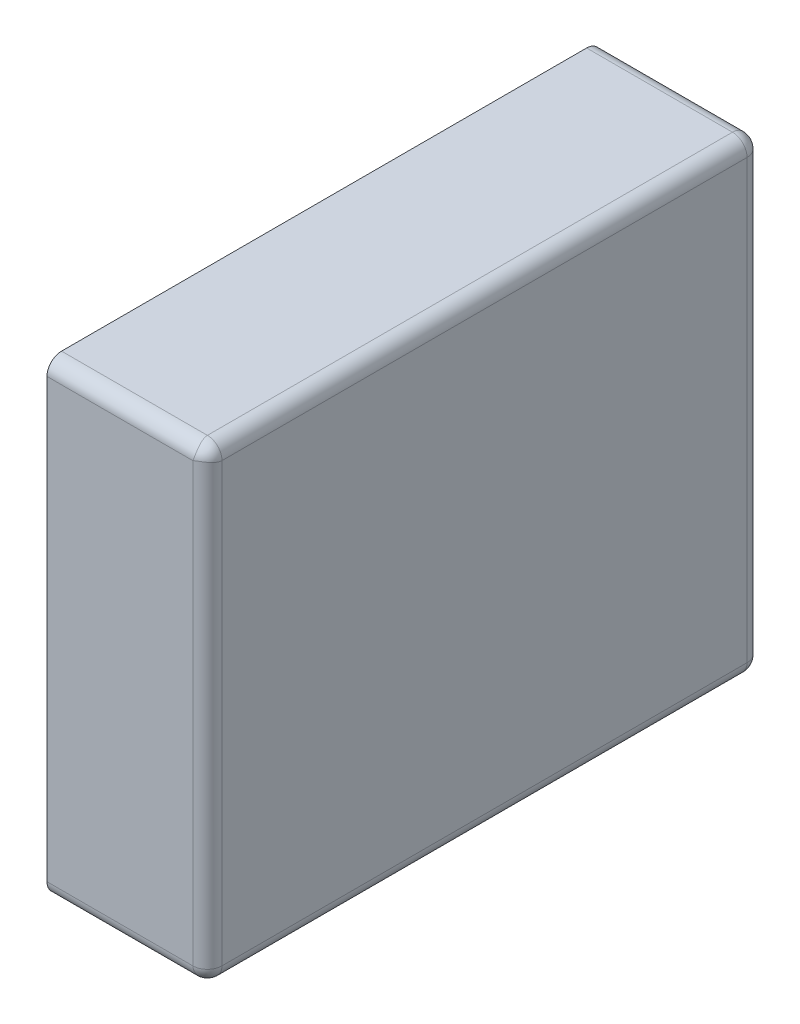
ISO-10303-21;
HEADER;
FILE_DESCRIPTION(('STEP AP214'),'2;1');
FILE_NAME('part.step','',(''),(''),'','','');
FILE_SCHEMA(('AUTOMOTIVE_DESIGN { 1 0 10303 214 1 1 1 1 }'));
ENDSEC;
DATA;
#1=APPLICATION_CONTEXT('core data for automotive mechanical design processes');
#2=APPLICATION_PROTOCOL_DEFINITION('international standard','automotive_design',2000,#1);
#3=PRODUCT_CONTEXT('',#1,'mechanical');
#4=PRODUCT('Part','Part','',(#3));
#5=PRODUCT_RELATED_PRODUCT_CATEGORY('part','',(#4));
#6=PRODUCT_DEFINITION_FORMATION('','',#4);
#7=PRODUCT_DEFINITION_CONTEXT('part definition',#1,'design');
#8=PRODUCT_DEFINITION('design','',#6,#7);
#9=PRODUCT_DEFINITION_SHAPE('','',#8);
#10=(LENGTH_UNIT() NAMED_UNIT(*) SI_UNIT(.MILLI.,.METRE.));
#11=(NAMED_UNIT(*) PLANE_ANGLE_UNIT() SI_UNIT($,.RADIAN.));
#12=(NAMED_UNIT(*) SI_UNIT($,.STERADIAN.) SOLID_ANGLE_UNIT());
#13=UNCERTAINTY_MEASURE_WITH_UNIT(LENGTH_MEASURE(1.E-05),#10,'distance_accuracy_value','');
#14=(GEOMETRIC_REPRESENTATION_CONTEXT(3) GLOBAL_UNCERTAINTY_ASSIGNED_CONTEXT((#13)) GLOBAL_UNIT_ASSIGNED_CONTEXT((#10,
#11,#12)) REPRESENTATION_CONTEXT('',''));
#15=CARTESIAN_POINT('',(0.,0.,0.));
#16=DIRECTION('',(0.,0.,1.));
#17=DIRECTION('',(1.,0.,0.));
#18=AXIS2_PLACEMENT_3D('',#15,#16,#17);
#19=CARTESIAN_POINT('',(0.25,-0.658333310554192,0.05));
#20=DIRECTION('',(-0.816496580927726,-0.408248290463864,-0.408248290463863));
#21=DIRECTION('',(0.577350269189626,-0.577350269189627,-0.577350269189625));
#22=AXIS2_PLACEMENT_3D('',#19,#20,#21);
#23=SPHERICAL_SURFACE('',#22,0.05);
#24=CARTESIAN_POINT('',(0.25,-0.658333310554192,0.05));
#25=DIRECTION('',(1.,0.,0.));
#26=DIRECTION('',(0.,0.,-1.));
#27=AXIS2_PLACEMENT_3D('',#24,#25,#26);
#28=CIRCLE('',#27,0.05);
#29=CARTESIAN_POINT('',(0.25,-0.708333310554192,0.05));
#30=VERTEX_POINT('',#29);
#31=CARTESIAN_POINT('',(0.25,-0.658333310554192,0.));
#32=VERTEX_POINT('',#31);
#33=EDGE_CURVE('E11',#30,#32,#28,.T.);
#34=ORIENTED_EDGE('',*,*,#33,.T.);
#35=CARTESIAN_POINT('',(0.25,-0.658333310554192,0.05));
#36=DIRECTION('',(0.,-1.,0.));
#37=DIRECTION('',(1.,0.,0.));
#38=AXIS2_PLACEMENT_3D('',#35,#36,#37);
#39=CIRCLE('',#38,0.05);
#40=CARTESIAN_POINT('',(0.3,-0.658333310554192,0.05));
#41=VERTEX_POINT('',#40);
#42=EDGE_CURVE('E24',#32,#41,#39,.T.);
#43=ORIENTED_EDGE('',*,*,#42,.T.);
#44=CARTESIAN_POINT('',(0.25,-0.658333310554192,0.05));
#45=DIRECTION('',(0.,0.,-1.));
#46=DIRECTION('',(0.,-1.,0.));
#47=AXIS2_PLACEMENT_3D('',#44,#45,#46);
#48=CIRCLE('',#47,0.05);
#49=EDGE_CURVE('E315',#41,#30,#48,.T.);
#50=ORIENTED_EDGE('',*,*,#49,.T.);
#51=EDGE_LOOP('',(#34,#43,#50));
#52=FACE_BOUND('',#51,.T.);
#53=ADVANCED_FACE('F17',(#52),#23,.T.);
#54=CARTESIAN_POINT('',(0.25,-0.658333310554192,1.85));
#55=DIRECTION('',(-0.408248290463863,-0.816496580927725,-0.408248290463864));
#56=DIRECTION('',(0.577350269189625,-0.577350269189627,0.577350269189626));
#57=AXIS2_PLACEMENT_3D('',#54,#55,#56);
#58=SPHERICAL_SURFACE('',#57,0.05);
#59=CARTESIAN_POINT('',(0.25,-0.658333310554192,1.9));
#60=CARTESIAN_POINT('',(0.250056476640882,-0.659164662981859,1.90000002031397));
#61=CARTESIAN_POINT('',(0.250121168311557,-0.65999542167902,1.89997917131755));
#62=CARTESIAN_POINT('',(0.250265391195623,-0.661657334802944,1.89989569556504));
#63=CARTESIAN_POINT('',(0.250344988001439,-0.66248847412573,1.89983288086806));
#64=CARTESIAN_POINT('',(0.250517234671643,-0.664148546660269,1.89966509757926));
#65=CARTESIAN_POINT('',(0.250609936033336,-0.664977457349145,1.89955995950256));
#66=CARTESIAN_POINT('',(0.250806520816706,-0.666630527199555,1.89930737239836));
#67=CARTESIAN_POINT('',(0.25091044290025,-0.667454658911413,1.89915977396341));
#68=CARTESIAN_POINT('',(0.251127528752862,-0.669095657803344,1.89882229239235));
#69=CARTESIAN_POINT('',(0.251240719867609,-0.669912494981016,1.89863228105857));
#70=CARTESIAN_POINT('',(0.251474344176626,-0.671536442570935,1.89821019528102));
#71=CARTESIAN_POINT('',(0.251594795122853,-0.672343522825329,1.89797801468437));
#72=CARTESIAN_POINT('',(0.251840892195576,-0.673945551721639,1.89747200526275));
#73=CARTESIAN_POINT('',(0.251966548375925,-0.674740472397371,1.89719809281404));
#74=CARTESIAN_POINT('',(0.252220973549075,-0.67631584408808,1.89660922840147));
#75=CARTESIAN_POINT('',(0.252349746928956,-0.677096271606362,1.89629421548598));
#76=CARTESIAN_POINT('',(0.252608300810853,-0.678640393971993,1.89562395131688));
#77=CARTESIAN_POINT('',(0.252738082163722,-0.679404071972065,1.89526866158421));
#78=CARTESIAN_POINT('',(0.252996535248399,-0.680912515415975,1.89451883535746));
#79=CARTESIAN_POINT('',(0.253125206487437,-0.681657272720296,1.89412428231988));
#80=CARTESIAN_POINT('',(0.253379323912972,-0.683125785626233,1.89329710837936));
#81=CARTESIAN_POINT('',(0.253504770480528,-0.683849543710642,1.89286449200134));
#82=CARTESIAN_POINT('',(0.253750336828149,-0.685274066953656,1.89196255359726));
#83=CARTESIAN_POINT('',(0.253870460068205,-0.685974846967864,1.89149325597784));
#84=CARTESIAN_POINT('',(0.254103304064891,-0.687351527474695,1.89051949570568));
#85=CARTESIAN_POINT('',(0.254216033516177,-0.688027456763577,1.89001507584848));
#86=CARTESIAN_POINT('',(0.254432052512975,-0.68935266005221,1.88897278428959));
#87=CARTESIAN_POINT('',(0.254535358057478,-0.690001978156978,1.88843497199004));
#88=CARTESIAN_POINT('',(0.254730542154479,-0.691272299809228,1.88732777460933));
#89=CARTESIAN_POINT('',(0.254822445957708,-0.691893363923171,1.88675846348493));
#90=CARTESIAN_POINT('',(0.254992901649071,-0.693105639944394,1.88559030584348));
#91=CARTESIAN_POINT('',(0.255071489829275,-0.693696929802492,1.88499154553938));
#92=CARTESIAN_POINT('',(0.255213463043959,-0.694848245829343,1.88376667689025));
#93=CARTESIAN_POINT('',(0.255276897009026,-0.695408368013381,1.88314066449634));
#94=CARTESIAN_POINT('',(0.255386795425953,-0.696496067335968,1.88186361983902));
#95=CARTESIAN_POINT('',(0.255433322818258,-0.697023758979868,1.88121269055809));
#96=CARTESIAN_POINT('',(0.255507737338678,-0.698045449350346,1.87988827123633));
#97=CARTESIAN_POINT('',(0.25553570253075,-0.698539581233155,1.87921488834858));
#98=CARTESIAN_POINT('',(0.255571427793508,-0.699493140439531,1.87784814127885));
#99=CARTESIAN_POINT('',(0.255579281877824,-0.699952719457549,1.87715488544524));
#100=CARTESIAN_POINT('',(0.255573335713261,-0.700836299644668,1.87575108108726));
#101=CARTESIAN_POINT('',(0.255559645939104,-0.701260470653455,1.87504063906048));
#102=CARTESIAN_POINT('',(0.255509287643763,-0.702072501389798,1.87360524818424));
#103=CARTESIAN_POINT('',(0.255472746231199,-0.702460548424196,1.87288040091383));
#104=CARTESIAN_POINT('',(0.255375493621831,-0.703199738480209,1.87141907045753));
#105=CARTESIAN_POINT('',(0.255314925981526,-0.70355108531067,1.87068268089524));
#106=CARTESIAN_POINT('',(0.255168570932992,-0.704216423264989,1.86920120834795));
#107=CARTESIAN_POINT('',(0.255082942970717,-0.704530633447628,1.86845620808787));
#108=CARTESIAN_POINT('',(0.254885566112575,-0.705121386709123,1.86696051703845));
#109=CARTESIAN_POINT('',(0.254773991607376,-0.705398162565069,1.86620989527186));
#110=CARTESIAN_POINT('',(0.254523973299393,-0.705913876381134,1.86470600292695));
#111=CARTESIAN_POINT('',(0.254385717519098,-0.706153059023342,1.8639527851382));
#112=CARTESIAN_POINT('',(0.254081755398417,-0.706593549745939,1.86244679638543));
#113=CARTESIAN_POINT('',(0.253916248962334,-0.706795112374401,1.86169405953744));
#114=CARTESIAN_POINT('',(0.253557343726359,-0.707160476248509,1.86019206042752));
#115=CARTESIAN_POINT('',(0.253364154831346,-0.707324539502695,1.85944281229227));
#116=CARTESIAN_POINT('',(0.253052732369609,-0.707542869289562,1.8583219455075));
#117=CARTESIAN_POINT('',(0.252945638881777,-0.707610870709135,1.85794983260432));
#118=CARTESIAN_POINT('',(0.252724431166697,-0.707737569445092,1.85720763742837));
#119=CARTESIAN_POINT('',(0.252610344441124,-0.707796300321971,1.85683755274195));
#120=CARTESIAN_POINT('',(0.252375149481327,-0.70790450391496,1.85609981269566));
#121=CARTESIAN_POINT('',(0.252254068989278,-0.707954010307306,1.85573215342186));
#122=CARTESIAN_POINT('',(0.252004892004011,-0.708043823540288,1.85499964182244));
#123=CARTESIAN_POINT('',(0.251876823418455,-0.708084164066007,1.85463478414168));
#124=CARTESIAN_POINT('',(0.25161368768569,-0.708155710450416,1.8539082563057));
#125=CARTESIAN_POINT('',(0.251478648512781,-0.708186949917715,1.85354657933213));
#126=CARTESIAN_POINT('',(0.251201599789781,-0.708240367053443,1.85282678964261));
#127=CARTESIAN_POINT('',(0.251059618183824,-0.708262578160602,1.85246866865684));
#128=CARTESIAN_POINT('',(0.250768722771826,-0.708298018075102,1.85175636445159));
#129=CARTESIAN_POINT('',(0.250619836783965,-0.70831128006162,1.85140217152902));
#130=CARTESIAN_POINT('',(0.250315184973883,-0.70832891062971,1.85069809533217));
#131=CARTESIAN_POINT('',(0.25015944673132,-0.708333312030094,1.85034820094293));
#132=CARTESIAN_POINT('',(0.25,-0.708333310554192,1.85));
#133=B_SPLINE_CURVE_WITH_KNOTS('',3,(#59,#60,#61,#62,#63,#64,#65,#66,#67,#68,#69,#70,#71,#72,
#73,#74,#75,#76,#77,#78,#79,#80,#81,#82,#83,#84,#85,#86,#87,#88,#89,#90,#91,#92,#93,#94,#95,#96,
#97,#98,#99,#100,#101,#102,#103,#104,#105,#106,#107,#108,#109,#110,#111,#112,#113,#114,#115,
#116,#117,#118,#119,#120,#121,#122,#123,#124,#125,#126,#127,#128,#129,#130,#131,#132),
.UNSPECIFIED.,.F.,.F.,(4,2,2,2,2,2,2,2,2,2,2,2,2,2,2,2,2,2,2,2,2,2,2,2,2,2,2,2,2,2,2,2,2,2,2,2,
4),(0.,0.00249945349828864,0.00501017636236172,0.00753105510997415,0.0100609150362242,
0.0125985278601288,0.0151426194708621,0.017691877752768,0.020244960471291,0.0228005032044077,
0.0253571273060391,0.0279134478892867,0.030468081818201,0.0330196556971654,0.035566813846877,
0.0381082262553105,0.0406425964909795,0.0431686695642027,0.0456852397199664,0.048191158143267,
0.050685340554528,0.0531667746687544,0.0556345274875088,0.0580877523875283,0.0605256959638786,
0.0629477045789643,0.0653532305615734,0.0677418379925142,0.0701132080055176,0.0712924926926686,
0.0724674051483095,0.0736379404537152,0.0748041017706803,0.0759659004268235,0.077123355986903,
0.0782764963093342,0.0794253575870824),.UNSPECIFIED.);
#134=CARTESIAN_POINT('',(0.25,-0.658333310554192,1.9));
#135=VERTEX_POINT('',#134);
#136=CARTESIAN_POINT('',(0.25,-0.708333310554192,1.85));
#137=VERTEX_POINT('',#136);
#138=EDGE_CURVE('E267',#135,#137,#133,.T.);
#139=ORIENTED_EDGE('',*,*,#138,.T.);
#140=CARTESIAN_POINT('',(0.25,-0.658333310554192,1.85));
#141=DIRECTION('',(0.,0.,1.));
#142=DIRECTION('',(1.,0.,0.));
#143=AXIS2_PLACEMENT_3D('',#140,#141,#142);
#144=CIRCLE('',#143,0.05);
#145=CARTESIAN_POINT('',(0.3,-0.658333310554192,1.85));
#146=VERTEX_POINT('',#145);
#147=EDGE_CURVE('E263',#137,#146,#144,.T.);
#148=ORIENTED_EDGE('',*,*,#147,.T.);
#149=CARTESIAN_POINT('',(0.25,-0.658333310554192,1.85));
#150=DIRECTION('',(0.,-1.,0.));
#151=DIRECTION('',(0.,0.,1.));
#152=AXIS2_PLACEMENT_3D('',#149,#150,#151);
#153=CIRCLE('',#152,0.05);
#154=EDGE_CURVE('E258',#146,#135,#153,.T.);
#155=ORIENTED_EDGE('',*,*,#154,.T.);
#156=EDGE_LOOP('',(#139,#148,#155));
#157=FACE_BOUND('',#156,.T.);
#158=ADVANCED_FACE('F292',(#157),#58,.T.);
#159=CARTESIAN_POINT('',(0.25,-0.658333310554192,0.));
#160=DIRECTION('',(0.,0.,1.));
#161=DIRECTION('',(0.707106781186548,-0.707106781186548,0.));
#162=AXIS2_PLACEMENT_3D('',#159,#160,#161);
#163=CYLINDRICAL_SURFACE('',#162,0.05);
#164=ORIENTED_EDGE('',*,*,#147,.F.);
#165=DIRECTION('',(0.,0.,-1.));
#166=VECTOR('',#165,1.);
#167=CARTESIAN_POINT('',(0.25,-0.708333310554192,0.));
#168=LINE('',#167,#166);
#169=EDGE_CURVE('E253',#137,#30,#168,.T.);
#170=ORIENTED_EDGE('',*,*,#169,.T.);
#171=ORIENTED_EDGE('',*,*,#49,.F.);
#172=DIRECTION('',(0.,0.,1.));
#173=VECTOR('',#172,1.);
#174=CARTESIAN_POINT('',(0.3,-0.658333310554192,0.));
#175=LINE('',#174,#173);
#176=EDGE_CURVE('E250',#41,#146,#175,.T.);
#177=ORIENTED_EDGE('',*,*,#176,.T.);
#178=EDGE_LOOP('',(#164,#170,#171,#177));
#179=FACE_BOUND('',#178,.T.);
#180=ADVANCED_FACE('F296',(#179),#163,.T.);
#181=CARTESIAN_POINT('',(0.25,0.841666689445808,0.05));
#182=DIRECTION('',(-0.408248290463862,-0.408248290463864,-0.816496580927726));
#183=DIRECTION('',(0.577350269189626,0.577350269189626,-0.577350269189626));
#184=AXIS2_PLACEMENT_3D('',#181,#182,#183);
#185=SPHERICAL_SURFACE('',#184,0.05);
#186=CARTESIAN_POINT('',(0.25,0.841666689445808,0.05));
#187=DIRECTION('',(0.,1.,0.));
#188=DIRECTION('',(0.,0.,-1.));
#189=AXIS2_PLACEMENT_3D('',#186,#187,#188);
#190=CIRCLE('',#189,0.05);
#191=CARTESIAN_POINT('',(0.3,0.841666689445808,0.05));
#192=VERTEX_POINT('',#191);
#193=CARTESIAN_POINT('',(0.25,0.841666689445808,0.));
#194=VERTEX_POINT('',#193);
#195=EDGE_CURVE('E248',#192,#194,#190,.T.);
#196=ORIENTED_EDGE('',*,*,#195,.T.);
#197=CARTESIAN_POINT('',(0.25,0.841666689445808,0.05));
#198=DIRECTION('',(1.,0.,0.));
#199=DIRECTION('',(0.,1.,0.));
#200=AXIS2_PLACEMENT_3D('',#197,#198,#199);
#201=CIRCLE('',#200,0.05);
#202=CARTESIAN_POINT('',(0.25,0.891666689445808,0.05));
#203=VERTEX_POINT('',#202);
#204=EDGE_CURVE('E246',#194,#203,#201,.T.);
#205=ORIENTED_EDGE('',*,*,#204,.T.);
#206=CARTESIAN_POINT('',(0.25,0.841666689445808,0.05));
#207=DIRECTION('',(0.,0.,-1.));
#208=DIRECTION('',(1.,0.,0.));
#209=AXIS2_PLACEMENT_3D('',#206,#207,#208);
#210=CIRCLE('',#209,0.05);
#211=EDGE_CURVE('E243',#203,#192,#210,.T.);
#212=ORIENTED_EDGE('',*,*,#211,.T.);
#213=EDGE_LOOP('',(#196,#205,#212));
#214=FACE_BOUND('',#213,.T.);
#215=ADVANCED_FACE('F301',(#214),#185,.T.);
#216=CARTESIAN_POINT('',(0.1625,0.841666689445808,0.05));
#217=DIRECTION('',(1.,0.,0.));
#218=DIRECTION('',(0.,0.707106781186548,-0.707106781186547));
#219=AXIS2_PLACEMENT_3D('',#216,#217,#218);
#220=CYLINDRICAL_SURFACE('',#219,0.05);
#221=CARTESIAN_POINT('',(-0.25,0.841666689445808,0.05));
#222=DIRECTION('',(1.,0.,0.));
#223=DIRECTION('',(0.,0.707106781186548,-0.707106781186547));
#224=AXIS2_PLACEMENT_3D('',#221,#222,#223);
#225=CIRCLE('',#224,0.05);
#226=CARTESIAN_POINT('',(-0.25,0.841666689445808,0.));
#227=VERTEX_POINT('',#226);
#228=CARTESIAN_POINT('',(-0.25,0.891666689445808,0.05));
#229=VERTEX_POINT('',#228);
#230=EDGE_CURVE('E239',#227,#229,#225,.T.);
#231=ORIENTED_EDGE('',*,*,#230,.T.);
#232=DIRECTION('',(1.,0.,0.));
#233=VECTOR('',#232,1.);
#234=CARTESIAN_POINT('',(0.1625,0.891666689445808,0.05));
#235=LINE('',#234,#233);
#236=EDGE_CURVE('E233',#229,#203,#235,.T.);
#237=ORIENTED_EDGE('',*,*,#236,.T.);
#238=ORIENTED_EDGE('',*,*,#204,.F.);
#239=DIRECTION('',(-1.,0.,0.));
#240=VECTOR('',#239,1.);
#241=CARTESIAN_POINT('',(0.1625,0.841666689445808,0.));
#242=LINE('',#241,#240);
#243=EDGE_CURVE('E231',#194,#227,#242,.T.);
#244=ORIENTED_EDGE('',*,*,#243,.T.);
#245=EDGE_LOOP('',(#231,#237,#238,#244));
#246=FACE_BOUND('',#245,.T.);
#247=ADVANCED_FACE('F194',(#246),#220,.T.);
#248=CARTESIAN_POINT('',(0.25,0.841666689445808,1.85));
#249=DIRECTION('',(0.408248290463863,0.408248290463863,-0.816496580927726));
#250=DIRECTION('',(0.577350269189625,0.577350269189626,0.577350269189626));
#251=AXIS2_PLACEMENT_3D('',#248,#249,#250);
#252=SPHERICAL_SURFACE('',#251,0.05);
#253=CARTESIAN_POINT('',(0.25,0.841666689445808,1.9));
#254=CARTESIAN_POINT('',(0.250348200942932,0.841826136177128,1.9000000014759));
#255=CARTESIAN_POINT('',(0.250698095332166,0.841981874419691,1.89999560007552));
#256=CARTESIAN_POINT('',(0.251402171529021,0.842286526229773,1.89997796950743));
#257=CARTESIAN_POINT('',(0.251756364451594,0.842435412217634,1.89996470752091));
#258=CARTESIAN_POINT('',(0.252468668656838,0.842726307629632,1.89992926760641));
#259=CARTESIAN_POINT('',(0.25282678964261,0.842868289235589,1.89990705649925));
#260=CARTESIAN_POINT('',(0.253546579332125,0.843145337958589,1.89985363936352));
#261=CARTESIAN_POINT('',(0.253908256305697,0.843280377131498,1.89982239989622));
#262=CARTESIAN_POINT('',(0.254634784141684,0.843543512864263,1.89975085351182));
#263=CARTESIAN_POINT('',(0.254999641822439,0.843671581449818,1.8997105129861));
#264=CARTESIAN_POINT('',(0.255732153421865,0.843920758435086,1.89962069975311));
#265=CARTESIAN_POINT('',(0.256099812695661,0.844041838927135,1.89957119336077));
#266=CARTESIAN_POINT('',(0.256837552741953,0.844277033886932,1.89946298976778));
#267=CARTESIAN_POINT('',(0.257207637428366,0.844391120612505,1.8994042588909));
#268=CARTESIAN_POINT('',(0.257949832604319,0.844612328327585,1.89927756015494));
#269=CARTESIAN_POINT('',(0.258321945507501,0.844719421815417,1.89920955873537));
#270=CARTESIAN_POINT('',(0.259442812292273,0.845030844277154,1.8989912289485));
#271=CARTESIAN_POINT('',(0.260192060427522,0.845224033172167,1.89882716569432));
#272=CARTESIAN_POINT('',(0.261694059537444,0.845582938408142,1.89846180182021));
#273=CARTESIAN_POINT('',(0.262446796385434,0.845748444844225,1.89826023919175));
#274=CARTESIAN_POINT('',(0.263952785138195,0.846052406964906,1.89781974846915));
#275=CARTESIAN_POINT('',(0.264706002926951,0.846190662745201,1.89758056582694));
#276=CARTESIAN_POINT('',(0.266209895271862,0.846440681053184,1.89706485201088));
#277=CARTESIAN_POINT('',(0.266960517038454,0.846552255558383,1.89678807615493));
#278=CARTESIAN_POINT('',(0.268456208087868,0.846749632416525,1.89619732289344));
#279=CARTESIAN_POINT('',(0.269201208347947,0.8468352603788,1.8958831127108));
#280=CARTESIAN_POINT('',(0.270682680895238,0.846981615427334,1.89521777475648));
#281=CARTESIAN_POINT('',(0.271419070457526,0.847042183067639,1.89486642792602));
#282=CARTESIAN_POINT('',(0.272880400913832,0.847139435677007,1.89412723787));
#283=CARTESIAN_POINT('',(0.273605248184243,0.84717597708957,1.89373919083561));
#284=CARTESIAN_POINT('',(0.275040639060477,0.847226335384912,1.89292716009926));
#285=CARTESIAN_POINT('',(0.275751081087255,0.847240025159069,1.89250298909048));
#286=CARTESIAN_POINT('',(0.277154885445235,0.847245971323632,1.89161940890336));
#287=CARTESIAN_POINT('',(0.277848141278855,0.847238117239316,1.89115982988534));
#288=CARTESIAN_POINT('',(0.279214888348585,0.847202391976558,1.89020627067896));
#289=CARTESIAN_POINT('',(0.279888271236327,0.847174426784487,1.88971213879615));
#290=CARTESIAN_POINT('',(0.281212690558093,0.847100012264066,1.88869044842568));
#291=CARTESIAN_POINT('',(0.281863619839021,0.847053484871761,1.88816275678178));
#292=CARTESIAN_POINT('',(0.283140664496341,0.846943586454834,1.88707505745919));
#293=CARTESIAN_POINT('',(0.283766676890247,0.846880152489767,1.88651493527515));
#294=CARTESIAN_POINT('',(0.28499154553938,0.846738179275083,1.8853636192483));
#295=CARTESIAN_POINT('',(0.285590305843476,0.846659591094879,1.8847723293902));
#296=CARTESIAN_POINT('',(0.286758463484926,0.846489135403516,1.88356005336898));
#297=CARTESIAN_POINT('',(0.287327774609329,0.846397231600287,1.88293898925504));
#298=CARTESIAN_POINT('',(0.288434971990044,0.846202047503286,1.88166866760279));
#299=CARTESIAN_POINT('',(0.288972784289588,0.846098741958783,1.88101934949802));
#300=CARTESIAN_POINT('',(0.290015075848481,0.845882722961985,1.87969414620939));
#301=CARTESIAN_POINT('',(0.290519495705679,0.845769993510699,1.8790182169205));
#302=CARTESIAN_POINT('',(0.291493255977843,0.845537149514013,1.87764153641367));
#303=CARTESIAN_POINT('',(0.291962553597264,0.845417026273957,1.87694075639946));
#304=CARTESIAN_POINT('',(0.292864492001337,0.845171459926336,1.87551623315645));
#305=CARTESIAN_POINT('',(0.293297108379355,0.84504601335878,1.87479247507204));
#306=CARTESIAN_POINT('',(0.294124282319878,0.844791895933245,1.8733239621661));
#307=CARTESIAN_POINT('',(0.294518835357465,0.844663224694207,1.87257920486178));
#308=CARTESIAN_POINT('',(0.295268661584212,0.84440477160953,1.87107076141787));
#309=CARTESIAN_POINT('',(0.29562395131688,0.844274990256661,1.8703070834178));
#310=CARTESIAN_POINT('',(0.29629421548598,0.844016436374764,1.86876296105217));
#311=CARTESIAN_POINT('',(0.296609228401466,0.843887662994882,1.86798253353389));
#312=CARTESIAN_POINT('',(0.297198092814035,0.843633237821733,1.86640716184318));
#313=CARTESIAN_POINT('',(0.297472005262752,0.843507581641384,1.86561224116745));
#314=CARTESIAN_POINT('',(0.297978014684369,0.843261484568661,1.86401021227114));
#315=CARTESIAN_POINT('',(0.298210195281024,0.843141033622434,1.86320313201674));
#316=CARTESIAN_POINT('',(0.298632281058567,0.842907409313417,1.86157918442682));
#317=CARTESIAN_POINT('',(0.298822292392348,0.84279421819867,1.86076234724915));
#318=CARTESIAN_POINT('',(0.299159773963409,0.842577132346058,1.85912134835722));
#319=CARTESIAN_POINT('',(0.299307372398355,0.842473210262514,1.85829721664536));
#320=CARTESIAN_POINT('',(0.299559959502557,0.842276625479144,1.85664414679495));
#321=CARTESIAN_POINT('',(0.299665097579262,0.842183924117451,1.85581523610608));
#322=CARTESIAN_POINT('',(0.299832880868058,0.842011677447247,1.85415516357154));
#323=CARTESIAN_POINT('',(0.299895695565037,0.841932080641431,1.85332402424875));
#324=CARTESIAN_POINT('',(0.299979171317549,0.841787857757365,1.85166211112483));
#325=CARTESIAN_POINT('',(0.300000020313967,0.84172316608669,1.85083135242767));
#326=CARTESIAN_POINT('',(0.3,0.841666689445808,1.85));
#327=B_SPLINE_CURVE_WITH_KNOTS('',3,(#253,#254,#255,#256,#257,#258,#259,#260,#261,#262,#263,
#264,#265,#266,#267,#268,#269,#270,#271,#272,#273,#274,#275,#276,#277,#278,#279,#280,#281,#282,
#283,#284,#285,#286,#287,#288,#289,#290,#291,#292,#293,#294,#295,#296,#297,#298,#299,#300,#301,
#302,#303,#304,#305,#306,#307,#308,#309,#310,#311,#312,#313,#314,#315,#316,#317,#318,#319,#320,
#321,#322,#323,#324,#325,#326),.UNSPECIFIED.,.F.,.F.,(4,2,2,2,2,2,2,2,2,2,2,2,2,2,2,2,2,2,2,2,2,
2,2,2,2,2,2,2,2,2,2,2,2,2,2,2,4),(0.,0.00114886127774824,0.00230200160017932,
0.00345945716025889,0.004621255816402,0.00578741713336713,0.00695795243877279,
0.00813286489441384,0.00931214958156473,0.0116835195945681,0.014072127025509,0.0164776530081181,
0.0188996616232038,0.0213376051995539,0.0237908300995735,0.026258582918328,0.0287400170325544,
0.0312341994438153,0.033740117867116,0.0362566880228796,0.0387827610961028,0.0413171313317718,
0.0438585437402055,0.046405701889917,0.0489572757688813,0.0515119096977955,0.0540682302810432,
0.0566248543826746,0.0591803971157913,0.0617334798343144,0.0642827381162204,0.0668268297269535,
0.069364442550858,0.071894302477108,0.0744151812247204,0.0769259040887936,0.0794253575870822),.UNSPECIFIED.);
#328=CARTESIAN_POINT('',(0.25,0.841666689445808,1.9));
#329=VERTEX_POINT('',#328);
#330=CARTESIAN_POINT('',(0.3,0.841666689445808,1.85));
#331=VERTEX_POINT('',#330);
#332=EDGE_CURVE('E217',#329,#331,#327,.T.);
#333=ORIENTED_EDGE('',*,*,#332,.T.);
#334=CARTESIAN_POINT('',(0.25,0.841666689445808,1.85));
#335=DIRECTION('',(0.,0.,1.));
#336=DIRECTION('',(0.,1.,0.));
#337=AXIS2_PLACEMENT_3D('',#334,#335,#336);
#338=CIRCLE('',#337,0.05);
#339=CARTESIAN_POINT('',(0.25,0.891666689445808,1.85));
#340=VERTEX_POINT('',#339);
#341=EDGE_CURVE('E215',#331,#340,#338,.T.);
#342=ORIENTED_EDGE('',*,*,#341,.T.);
#343=CARTESIAN_POINT('',(0.25,0.891666689445808,1.85));
#344=CARTESIAN_POINT('',(0.250056476640882,0.891666709759775,1.85083135242767));
#345=CARTESIAN_POINT('',(0.250121168311557,0.891645860763357,1.85166211112483));
#346=CARTESIAN_POINT('',(0.250265391195623,0.891562385010845,1.85332402424875));
#347=CARTESIAN_POINT('',(0.250344988001439,0.891499570313866,1.85415516357154));
#348=CARTESIAN_POINT('',(0.250517234671643,0.89133178702507,1.85581523610608));
#349=CARTESIAN_POINT('',(0.250609936033336,0.891226648948365,1.85664414679495));
#350=CARTESIAN_POINT('',(0.250806520816706,0.890974061844164,1.85829721664536));
#351=CARTESIAN_POINT('',(0.25091044290025,0.890826463409217,1.85912134835722));
#352=CARTESIAN_POINT('',(0.251127528752862,0.890488981838156,1.86076234724915));
#353=CARTESIAN_POINT('',(0.251240719867609,0.890298970504375,1.86157918442682));
#354=CARTESIAN_POINT('',(0.251474344176626,0.889876884726832,1.86320313201674));
#355=CARTESIAN_POINT('',(0.251594795122853,0.889644704130177,1.86401021227114));
#356=CARTESIAN_POINT('',(0.251840892195575,0.88913869470856,1.86561224116745));
#357=CARTESIAN_POINT('',(0.251966548375925,0.888864782259843,1.86640716184318));
#358=CARTESIAN_POINT('',(0.252220973549075,0.888275917847274,1.86798253353389));
#359=CARTESIAN_POINT('',(0.252349746928956,0.887960904931787,1.86876296105217));
#360=CARTESIAN_POINT('',(0.252608300810853,0.887290640762688,1.8703070834178));
#361=CARTESIAN_POINT('',(0.252738082163722,0.88693535103002,1.87107076141787));
#362=CARTESIAN_POINT('',(0.252996535248399,0.886185524803273,1.87257920486178));
#363=CARTESIAN_POINT('',(0.253125206487437,0.885790971765686,1.8733239621661));
#364=CARTESIAN_POINT('',(0.253379323912972,0.884963797825163,1.87479247507204));
#365=CARTESIAN_POINT('',(0.253504770480528,0.884531181447145,1.87551623315645));
#366=CARTESIAN_POINT('',(0.253750336828149,0.883629243043072,1.87694075639946));
#367=CARTESIAN_POINT('',(0.253870460068205,0.883159945423651,1.87764153641367));
#368=CARTESIAN_POINT('',(0.254103304064891,0.882186185151487,1.8790182169205));
#369=CARTESIAN_POINT('',(0.254216033516177,0.881681765294289,1.87969414620939));
#370=CARTESIAN_POINT('',(0.254432052512974,0.880639473735396,1.88101934949802));
#371=CARTESIAN_POINT('',(0.254535358057478,0.880101661435852,1.88166866760279));
#372=CARTESIAN_POINT('',(0.254730542154479,0.878994464055137,1.88293898925504));
#373=CARTESIAN_POINT('',(0.254822445957708,0.878425152930734,1.88356005336898));
#374=CARTESIAN_POINT('',(0.254992901649071,0.877256995289284,1.8847723293902));
#375=CARTESIAN_POINT('',(0.255071489829275,0.876658234985188,1.8853636192483));
#376=CARTESIAN_POINT('',(0.255213463043959,0.875433366336055,1.88651493527515));
#377=CARTESIAN_POINT('',(0.255276897009026,0.874807353942149,1.88707505745919));
#378=CARTESIAN_POINT('',(0.255386795425953,0.873530309284829,1.88816275678178));
#379=CARTESIAN_POINT('',(0.255433322818258,0.872879380003901,1.88869044842568));
#380=CARTESIAN_POINT('',(0.255507737338678,0.871554960682135,1.88971213879615));
#381=CARTESIAN_POINT('',(0.25553570253075,0.870881577794393,1.89020627067896));
#382=CARTESIAN_POINT('',(0.255571427793508,0.869514830724663,1.89115982988534));
#383=CARTESIAN_POINT('',(0.255579281877824,0.868821574891043,1.89161940890336));
#384=CARTESIAN_POINT('',(0.255573335713261,0.867417770533063,1.89250298909048));
#385=CARTESIAN_POINT('',(0.255559645939104,0.866707328506285,1.89292716009926));
#386=CARTESIAN_POINT('',(0.255509287643763,0.865271937630051,1.89373919083561));
#387=CARTESIAN_POINT('',(0.255472746231199,0.86454709035964,1.89412723787));
#388=CARTESIAN_POINT('',(0.255375493621831,0.863085759903334,1.89486642792602));
#389=CARTESIAN_POINT('',(0.255314925981525,0.862349370341046,1.89521777475648));
#390=CARTESIAN_POINT('',(0.255168570932992,0.860867897793755,1.8958831127108));
#391=CARTESIAN_POINT('',(0.255082942970717,0.860122897533676,1.89619732289344));
#392=CARTESIAN_POINT('',(0.254885566112575,0.858627206484262,1.89678807615493));
#393=CARTESIAN_POINT('',(0.254773991607376,0.85787658471767,1.89706485201088));
#394=CARTESIAN_POINT('',(0.254523973299393,0.856372692372759,1.89758056582694));
#395=CARTESIAN_POINT('',(0.254385717519098,0.855619474584003,1.89781974846915));
#396=CARTESIAN_POINT('',(0.254081755398417,0.854113485831242,1.89826023919175));
#397=CARTESIAN_POINT('',(0.253916248962334,0.853360748983252,1.89846180182021));
#398=CARTESIAN_POINT('',(0.253557343726359,0.85185874987333,1.89882716569432));
#399=CARTESIAN_POINT('',(0.253364154831346,0.851109501738081,1.8989912289485));
#400=CARTESIAN_POINT('',(0.253052732369609,0.849988634953309,1.89920955873537));
#401=CARTESIAN_POINT('',(0.252945638881777,0.849616522050126,1.89927756015494));
#402=CARTESIAN_POINT('',(0.252724431166697,0.848874326874174,1.8994042588909));
#403=CARTESIAN_POINT('',(0.252610344441124,0.848504242187761,1.89946298976778));
#404=CARTESIAN_POINT('',(0.252375149481327,0.847766502141469,1.89957119336077));
#405=CARTESIAN_POINT('',(0.252254068989278,0.847398842867673,1.89962069975311));
#406=CARTESIAN_POINT('',(0.252004892004011,0.846666331268247,1.8997105129861));
#407=CARTESIAN_POINT('',(0.251876823418455,0.846301473587492,1.89975085351182));
#408=CARTESIAN_POINT('',(0.25161368768569,0.845574945751505,1.89982239989622));
#409=CARTESIAN_POINT('',(0.251478648512781,0.845213268777933,1.89985363936352));
#410=CARTESIAN_POINT('',(0.251201599789781,0.844493479088418,1.89990705649925));
#411=CARTESIAN_POINT('',(0.251059618183824,0.844135358102647,1.89992926760641));
#412=CARTESIAN_POINT('',(0.250768722771826,0.843423053897402,1.89996470752091));
#413=CARTESIAN_POINT('',(0.250619836783965,0.843068860974829,1.89997796950743));
#414=CARTESIAN_POINT('',(0.250315184973883,0.842364784777974,1.89999560007552));
#415=CARTESIAN_POINT('',(0.25015944673132,0.84201489038874,1.9000000014759));
#416=CARTESIAN_POINT('',(0.25,0.841666689445808,1.9));
#417=B_SPLINE_CURVE_WITH_KNOTS('',3,(#343,#344,#345,#346,#347,#348,#349,#350,#351,#352,#353,
#354,#355,#356,#357,#358,#359,#360,#361,#362,#363,#364,#365,#366,#367,#368,#369,#370,#371,#372,
#373,#374,#375,#376,#377,#378,#379,#380,#381,#382,#383,#384,#385,#386,#387,#388,#389,#390,#391,
#392,#393,#394,#395,#396,#397,#398,#399,#400,#401,#402,#403,#404,#405,#406,#407,#408,#409,#410,
#411,#412,#413,#414,#415,#416),.UNSPECIFIED.,.F.,.F.,(4,2,2,2,2,2,2,2,2,2,2,2,2,2,2,2,2,2,2,2,2,
2,2,2,2,2,2,2,2,2,2,2,2,2,2,2,4),(0.,0.00249945349828843,0.00501017636236163,
0.00753105510997417,0.010060915036224,0.0125985278601287,0.0151426194708618,0.0176918777527678,
0.0202449604712909,0.0228005032044074,0.0253571273060388,0.0279134478892866,0.0304680818182008,
0.0330196556971652,0.0355668138468767,0.0381082262553104,0.0406425964909794,0.0431686695642026,
0.0456852397199662,0.0481911581432669,0.0506853405545278,0.0531667746687541,0.0556345274875086,
0.0580877523875282,0.0605256959638784,0.0629477045789642,0.0653532305615732,0.0677418379925141,
0.0701132080055175,0.0712924926926684,0.0724674051483094,0.073637940453715,0.0748041017706802,
0.0759659004268233,0.0771233559869028,0.078276496309334,0.0794253575870822),.UNSPECIFIED.);
#418=EDGE_CURVE('E165',#340,#329,#417,.T.);
#419=ORIENTED_EDGE('',*,*,#418,.T.);
#420=EDGE_LOOP('',(#333,#342,#419));
#421=FACE_BOUND('',#420,.T.);
#422=ADVANCED_FACE('F189',(#421),#252,.T.);
#423=CARTESIAN_POINT('',(0.25,0.841666689445808,0.));
#424=DIRECTION('',(0.,0.,1.));
#425=DIRECTION('',(0.707106781186548,0.707106781186548,0.));
#426=AXIS2_PLACEMENT_3D('',#423,#424,#425);
#427=CYLINDRICAL_SURFACE('',#426,0.05);
#428=ORIENTED_EDGE('',*,*,#341,.F.);
#429=DIRECTION('',(0.,0.,-1.));
#430=VECTOR('',#429,1.);
#431=CARTESIAN_POINT('',(0.3,0.841666689445808,0.));
#432=LINE('',#431,#430);
#433=EDGE_CURVE('E160',#331,#192,#432,.T.);
#434=ORIENTED_EDGE('',*,*,#433,.T.);
#435=ORIENTED_EDGE('',*,*,#211,.F.);
#436=DIRECTION('',(0.,0.,1.));
#437=VECTOR('',#436,1.);
#438=CARTESIAN_POINT('',(0.25,0.891666689445808,0.));
#439=LINE('',#438,#437);
#440=EDGE_CURVE('E155',#203,#340,#439,.T.);
#441=ORIENTED_EDGE('',*,*,#440,.T.);
#442=EDGE_LOOP('',(#428,#434,#435,#441));
#443=FACE_BOUND('',#442,.T.);
#444=ADVANCED_FACE('F183',(#443),#427,.T.);
#445=CARTESIAN_POINT('',(0.1625,0.841666689445808,1.85));
#446=DIRECTION('',(-1.,0.,0.));
#447=DIRECTION('',(0.,0.707106781186548,0.707106781186548));
#448=AXIS2_PLACEMENT_3D('',#445,#446,#447);
#449=CYLINDRICAL_SURFACE('',#448,0.05);
#450=CARTESIAN_POINT('',(-0.25,0.841666689445808,1.85));
#451=DIRECTION('',(1.,0.,0.));
#452=DIRECTION('',(0.,0.707106781186548,0.707106781186548));
#453=AXIS2_PLACEMENT_3D('',#450,#451,#452);
#454=CIRCLE('',#453,0.05);
#455=CARTESIAN_POINT('',(-0.25,0.891666689445808,1.85));
#456=VERTEX_POINT('',#455);
#457=CARTESIAN_POINT('',(-0.25,0.841666689445808,1.9));
#458=VERTEX_POINT('',#457);
#459=EDGE_CURVE('E153',#456,#458,#454,.T.);
#460=ORIENTED_EDGE('',*,*,#459,.T.);
#461=DIRECTION('',(1.,0.,0.));
#462=VECTOR('',#461,1.);
#463=CARTESIAN_POINT('',(0.1625,0.841666689445808,1.9));
#464=LINE('',#463,#462);
#465=EDGE_CURVE('E148',#458,#329,#464,.T.);
#466=ORIENTED_EDGE('',*,*,#465,.T.);
#467=ORIENTED_EDGE('',*,*,#418,.F.);
#468=DIRECTION('',(-1.,0.,0.));
#469=VECTOR('',#468,1.);
#470=CARTESIAN_POINT('',(0.1625,0.891666689445808,1.85));
#471=LINE('',#470,#469);
#472=EDGE_CURVE('E143',#340,#456,#471,.T.);
#473=ORIENTED_EDGE('',*,*,#472,.T.);
#474=EDGE_LOOP('',(#460,#466,#467,#473));
#475=FACE_BOUND('',#474,.T.);
#476=ADVANCED_FACE('F172',(#475),#449,.T.);
#477=CARTESIAN_POINT('',(0.25,-0.308333310554192,1.85));
#478=DIRECTION('',(0.,1.,0.));
#479=DIRECTION('',(0.707106781186548,0.,0.707106781186548));
#480=AXIS2_PLACEMENT_3D('',#477,#478,#479);
#481=CYLINDRICAL_SURFACE('',#480,0.05);
#482=ORIENTED_EDGE('',*,*,#332,.F.);
#483=DIRECTION('',(0.,-1.,0.));
#484=VECTOR('',#483,1.);
#485=CARTESIAN_POINT('',(0.25,-0.308333310554192,1.9));
#486=LINE('',#485,#484);
#487=EDGE_CURVE('E138',#329,#135,#486,.T.);
#488=ORIENTED_EDGE('',*,*,#487,.T.);
#489=ORIENTED_EDGE('',*,*,#154,.F.);
#490=DIRECTION('',(0.,1.,0.));
#491=VECTOR('',#490,1.);
#492=CARTESIAN_POINT('',(0.3,-0.308333310554192,1.85));
#493=LINE('',#492,#491);
#494=EDGE_CURVE('E133',#146,#331,#493,.T.);
#495=ORIENTED_EDGE('',*,*,#494,.T.);
#496=EDGE_LOOP('',(#482,#488,#489,#495));
#497=FACE_BOUND('',#496,.T.);
#498=ADVANCED_FACE('F182',(#497),#481,.T.);
#499=CARTESIAN_POINT('',(0.25,-0.308333310554192,0.05));
#500=DIRECTION('',(0.,-1.,0.));
#501=DIRECTION('',(0.707106781186548,0.,-0.707106781186547));
#502=AXIS2_PLACEMENT_3D('',#499,#500,#501);
#503=CYLINDRICAL_SURFACE('',#502,0.05);
#504=ORIENTED_EDGE('',*,*,#42,.F.);
#505=DIRECTION('',(0.,1.,0.));
#506=VECTOR('',#505,1.);
#507=CARTESIAN_POINT('',(0.25,-0.308333310554192,0.));
#508=LINE('',#507,#506);
#509=EDGE_CURVE('E130',#32,#194,#508,.T.);
#510=ORIENTED_EDGE('',*,*,#509,.T.);
#511=ORIENTED_EDGE('',*,*,#195,.F.);
#512=DIRECTION('',(0.,-1.,0.));
#513=VECTOR('',#512,1.);
#514=CARTESIAN_POINT('',(0.3,-0.308333310554192,0.05));
#515=LINE('',#514,#513);
#516=EDGE_CURVE('E127',#192,#41,#515,.T.);
#517=ORIENTED_EDGE('',*,*,#516,.T.);
#518=EDGE_LOOP('',(#504,#510,#511,#517));
#519=FACE_BOUND('',#518,.T.);
#520=ADVANCED_FACE('F282',(#519),#503,.T.);
#521=CARTESIAN_POINT('',(-0.1125,-0.658333310554192,1.85));
#522=DIRECTION('',(1.,0.,0.));
#523=DIRECTION('',(0.,-0.707106781186548,0.707106781186548));
#524=AXIS2_PLACEMENT_3D('',#521,#522,#523);
#525=CYLINDRICAL_SURFACE('',#524,0.05);
#526=CARTESIAN_POINT('',(-0.25,-0.658333310554192,1.85));
#527=DIRECTION('',(1.,0.,0.));
#528=DIRECTION('',(0.,-0.707106781186548,0.707106781186548));
#529=AXIS2_PLACEMENT_3D('',#526,#527,#528);
#530=CIRCLE('',#529,0.05);
#531=CARTESIAN_POINT('',(-0.25,-0.658333310554192,1.9));
#532=VERTEX_POINT('',#531);
#533=CARTESIAN_POINT('',(-0.25,-0.708333310554192,1.85));
#534=VERTEX_POINT('',#533);
#535=EDGE_CURVE('E125',#532,#534,#530,.T.);
#536=ORIENTED_EDGE('',*,*,#535,.T.);
#537=DIRECTION('',(1.,0.,0.));
#538=VECTOR('',#537,1.);
#539=CARTESIAN_POINT('',(-0.1125,-0.708333310554192,1.85));
#540=LINE('',#539,#538);
#541=EDGE_CURVE('E109',#534,#137,#540,.T.);
#542=ORIENTED_EDGE('',*,*,#541,.T.);
#543=ORIENTED_EDGE('',*,*,#138,.F.);
#544=DIRECTION('',(-1.,0.,0.));
#545=VECTOR('',#544,1.);
#546=CARTESIAN_POINT('',(-0.1125,-0.658333310554192,1.9));
#547=LINE('',#546,#545);
#548=EDGE_CURVE('E97',#135,#532,#547,.T.);
#549=ORIENTED_EDGE('',*,*,#548,.T.);
#550=EDGE_LOOP('',(#536,#542,#543,#549));
#551=FACE_BOUND('',#550,.T.);
#552=ADVANCED_FACE('F273',(#551),#525,.T.);
#553=CARTESIAN_POINT('',(-0.1125,-0.658333310554192,0.05));
#554=DIRECTION('',(-1.,0.,0.));
#555=DIRECTION('',(0.,-0.707106781186548,-0.707106781186547));
#556=AXIS2_PLACEMENT_3D('',#553,#554,#555);
#557=CYLINDRICAL_SURFACE('',#556,0.05);
#558=CARTESIAN_POINT('',(-0.25,-0.658333310554192,0.05));
#559=DIRECTION('',(1.,0.,0.));
#560=DIRECTION('',(0.,-0.707106781186548,-0.707106781186547));
#561=AXIS2_PLACEMENT_3D('',#558,#559,#560);
#562=CIRCLE('',#561,0.05);
#563=CARTESIAN_POINT('',(-0.25,-0.708333310554192,0.05));
#564=VERTEX_POINT('',#563);
#565=CARTESIAN_POINT('',(-0.25,-0.658333310554192,0.));
#566=VERTEX_POINT('',#565);
#567=EDGE_CURVE('E90',#564,#566,#562,.T.);
#568=ORIENTED_EDGE('',*,*,#567,.T.);
#569=DIRECTION('',(1.,0.,0.));
#570=VECTOR('',#569,1.);
#571=CARTESIAN_POINT('',(-0.1125,-0.658333310554192,0.));
#572=LINE('',#571,#570);
#573=EDGE_CURVE('E98',#566,#32,#572,.T.);
#574=ORIENTED_EDGE('',*,*,#573,.T.);
#575=ORIENTED_EDGE('',*,*,#33,.F.);
#576=DIRECTION('',(-1.,0.,0.));
#577=VECTOR('',#576,1.);
#578=CARTESIAN_POINT('',(-0.1125,-0.708333310554192,0.05));
#579=LINE('',#578,#577);
#580=EDGE_CURVE('E101',#30,#564,#579,.T.);
#581=ORIENTED_EDGE('',*,*,#580,.T.);
#582=EDGE_LOOP('',(#568,#574,#575,#581));
#583=FACE_BOUND('',#582,.T.);
#584=ADVANCED_FACE('F102',(#583),#557,.T.);
#585=CARTESIAN_POINT('',(-0.25,-0.708333310554192,0.));
#586=DIRECTION('',(0.,-1.,0.));
#587=DIRECTION('',(1.,0.,0.));
#588=AXIS2_PLACEMENT_3D('',#585,#586,#587);
#589=PLANE('',#588);
#590=ORIENTED_EDGE('',*,*,#580,.F.);
#591=ORIENTED_EDGE('',*,*,#169,.F.);
#592=ORIENTED_EDGE('',*,*,#541,.F.);
#593=DIRECTION('',(0.,0.,1.));
#594=VECTOR('',#593,1.);
#595=CARTESIAN_POINT('',(-0.25,-0.708333310554192,0.));
#596=LINE('',#595,#594);
#597=EDGE_CURVE('E93',#564,#534,#596,.T.);
#598=ORIENTED_EDGE('',*,*,#597,.F.);
#599=EDGE_LOOP('',(#590,#591,#592,#598));
#600=FACE_BOUND('',#599,.T.);
#601=ADVANCED_FACE('F107',(#600),#589,.T.);
#602=CARTESIAN_POINT('',(0.0250000000000001,0.0916666894458079,1.9));
#603=DIRECTION('',(0.,0.,1.));
#604=DIRECTION('',(1.,0.,0.));
#605=AXIS2_PLACEMENT_3D('',#602,#603,#604);
#606=PLANE('',#605);
#607=ORIENTED_EDGE('',*,*,#548,.F.);
#608=ORIENTED_EDGE('',*,*,#487,.F.);
#609=ORIENTED_EDGE('',*,*,#465,.F.);
#610=DIRECTION('',(0.,-1.,0.));
#611=VECTOR('',#610,1.);
#612=CARTESIAN_POINT('',(-0.25,-0.708333310554192,1.9));
#613=LINE('',#612,#611);
#614=EDGE_CURVE('E110',#458,#532,#613,.T.);
#615=ORIENTED_EDGE('',*,*,#614,.T.);
#616=EDGE_LOOP('',(#607,#608,#609,#615));
#617=FACE_BOUND('',#616,.T.);
#618=ADVANCED_FACE('F331',(#617),#606,.T.);
#619=CARTESIAN_POINT('',(0.3,-0.708333310554192,0.));
#620=DIRECTION('',(1.,0.,0.));
#621=DIRECTION('',(0.,1.,0.));
#622=AXIS2_PLACEMENT_3D('',#619,#620,#621);
#623=PLANE('',#622);
#624=ORIENTED_EDGE('',*,*,#433,.F.);
#625=ORIENTED_EDGE('',*,*,#494,.F.);
#626=ORIENTED_EDGE('',*,*,#176,.F.);
#627=ORIENTED_EDGE('',*,*,#516,.F.);
#628=EDGE_LOOP('',(#624,#625,#626,#627));
#629=FACE_BOUND('',#628,.T.);
#630=ADVANCED_FACE('F322',(#629),#623,.T.);
#631=CARTESIAN_POINT('',(-0.25,0.891666689445808,0.));
#632=DIRECTION('',(-1.,0.,0.));
#633=DIRECTION('',(0.,-1.,0.));
#634=AXIS2_PLACEMENT_3D('',#631,#632,#633);
#635=PLANE('',#634);
#636=ORIENTED_EDGE('',*,*,#567,.F.);
#637=ORIENTED_EDGE('',*,*,#597,.T.);
#638=ORIENTED_EDGE('',*,*,#535,.F.);
#639=ORIENTED_EDGE('',*,*,#614,.F.);
#640=ORIENTED_EDGE('',*,*,#459,.F.);
#641=DIRECTION('',(0.,0.,1.));
#642=VECTOR('',#641,1.);
#643=CARTESIAN_POINT('',(-0.25,0.891666689445808,0.));
#644=LINE('',#643,#642);
#645=EDGE_CURVE('E113',#229,#456,#644,.T.);
#646=ORIENTED_EDGE('',*,*,#645,.F.);
#647=ORIENTED_EDGE('',*,*,#230,.F.);
#648=DIRECTION('',(0.,1.,0.));
#649=VECTOR('',#648,1.);
#650=CARTESIAN_POINT('',(-0.25,-0.708333310554192,0.));
#651=LINE('',#650,#649);
#652=EDGE_CURVE('E95',#566,#227,#651,.T.);
#653=ORIENTED_EDGE('',*,*,#652,.F.);
#654=EDGE_LOOP('',(#636,#637,#638,#639,#640,#646,#647,#653));
#655=FACE_BOUND('',#654,.T.);
#656=ADVANCED_FACE('F91',(#655),#635,.T.);
#657=CARTESIAN_POINT('',(0.3,0.891666689445808,0.));
#658=DIRECTION('',(0.,1.,0.));
#659=DIRECTION('',(-1.,0.,0.));
#660=AXIS2_PLACEMENT_3D('',#657,#658,#659);
#661=PLANE('',#660);
#662=ORIENTED_EDGE('',*,*,#236,.F.);
#663=ORIENTED_EDGE('',*,*,#645,.T.);
#664=ORIENTED_EDGE('',*,*,#472,.F.);
#665=ORIENTED_EDGE('',*,*,#440,.F.);
#666=EDGE_LOOP('',(#662,#663,#664,#665));
#667=FACE_BOUND('',#666,.T.);
#668=ADVANCED_FACE('F339',(#667),#661,.T.);
#669=CARTESIAN_POINT('',(0.0250000000000001,0.0916666894458079,0.));
#670=DIRECTION('',(0.,0.,1.));
#671=DIRECTION('',(1.,0.,0.));
#672=AXIS2_PLACEMENT_3D('',#669,#670,#671);
#673=PLANE('',#672);
#674=ORIENTED_EDGE('',*,*,#573,.F.);
#675=ORIENTED_EDGE('',*,*,#652,.T.);
#676=ORIENTED_EDGE('',*,*,#243,.F.);
#677=ORIENTED_EDGE('',*,*,#509,.F.);
#678=EDGE_LOOP('',(#674,#675,#676,#677));
#679=FACE_BOUND('',#678,.T.);
#680=ADVANCED_FACE('F337',(#679),#673,.F.);
#681=CLOSED_SHELL('',(#53,#158,#180,#215,#247,#422,#444,#476,#498,#520,#552,#584,#601,#618,#630,
#656,#668,#680));
#682=MANIFOLD_SOLID_BREP('B1',#681);
#683=ADVANCED_BREP_SHAPE_REPRESENTATION('',(#18,#682),#14);
#684=SHAPE_DEFINITION_REPRESENTATION(#9,#683);
ENDSEC;
END-ISO-10303-21;
